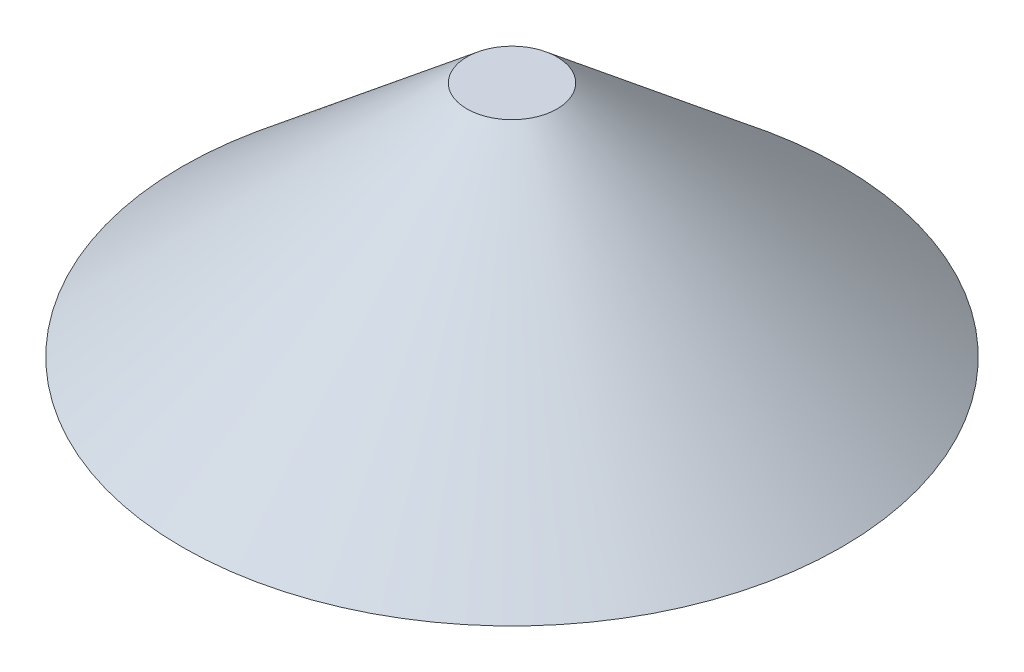
ISO-10303-21;
HEADER;
FILE_DESCRIPTION(('STEP AP214'),'2;1');
FILE_NAME('part.step','',(''),(''),'','','');
FILE_SCHEMA(('AUTOMOTIVE_DESIGN { 1 0 10303 214 1 1 1 1 }'));
ENDSEC;
DATA;
#1=APPLICATION_CONTEXT('core data for automotive mechanical design processes');
#2=APPLICATION_PROTOCOL_DEFINITION('international standard','automotive_design',2000,#1);
#3=PRODUCT_CONTEXT('',#1,'mechanical');
#4=PRODUCT('Part','Part','',(#3));
#5=PRODUCT_RELATED_PRODUCT_CATEGORY('part','',(#4));
#6=PRODUCT_DEFINITION_FORMATION('','',#4);
#7=PRODUCT_DEFINITION_CONTEXT('part definition',#1,'design');
#8=PRODUCT_DEFINITION('design','',#6,#7);
#9=PRODUCT_DEFINITION_SHAPE('','',#8);
#10=(LENGTH_UNIT() NAMED_UNIT(*) SI_UNIT(.MILLI.,.METRE.));
#11=(NAMED_UNIT(*) PLANE_ANGLE_UNIT() SI_UNIT($,.RADIAN.));
#12=(NAMED_UNIT(*) SI_UNIT($,.STERADIAN.) SOLID_ANGLE_UNIT());
#13=UNCERTAINTY_MEASURE_WITH_UNIT(LENGTH_MEASURE(1.E-05),#10,'distance_accuracy_value','');
#14=(GEOMETRIC_REPRESENTATION_CONTEXT(3) GLOBAL_UNCERTAINTY_ASSIGNED_CONTEXT((#13)) GLOBAL_UNIT_ASSIGNED_CONTEXT((#10,
#11,#12)) REPRESENTATION_CONTEXT('',''));
#15=CARTESIAN_POINT('',(0.,0.,0.));
#16=DIRECTION('',(0.,0.,1.));
#17=DIRECTION('',(1.,0.,0.));
#18=AXIS2_PLACEMENT_3D('',#15,#16,#17);
#19=CARTESIAN_POINT('',(0.,0.,0.));
#20=DIRECTION('',(0.,-1.,0.));
#21=DIRECTION('',(0.,0.,-1.));
#22=AXIS2_PLACEMENT_3D('',#19,#20,#21);
#23=PLANE('',#22);
#24=CARTESIAN_POINT('',(0.,0.,0.));
#25=DIRECTION('',(0.,1.,0.));
#26=DIRECTION('',(0.,0.,1.));
#27=AXIS2_PLACEMENT_3D('',#24,#25,#26);
#28=CIRCLE('',#27,69.5);
#29=CARTESIAN_POINT('',(0.,0.,69.5));
#30=VERTEX_POINT('',#29);
#31=EDGE_CURVE('E10',#30,#30,#28,.T.);
#32=ORIENTED_EDGE('',*,*,#31,.F.);
#33=EDGE_LOOP('',(#32));
#34=FACE_BOUND('',#33,.T.);
#35=ADVANCED_FACE('F39',(#34),#23,.T.);
#36=CARTESIAN_POINT('',(0.,50.,0.));
#37=DIRECTION('',(0.,-1.,0.));
#38=DIRECTION('',(0.,0.,-1.));
#39=AXIS2_PLACEMENT_3D('',#36,#37,#38);
#40=CONICAL_SURFACE('',#39,9.50000000000002,0.876058050598193);
#41=ORIENTED_EDGE('',*,*,#31,.T.);
#42=EDGE_LOOP('',(#41));
#43=FACE_BOUND('',#42,.T.);
#44=CARTESIAN_POINT('',(0.,50.,0.));
#45=DIRECTION('',(0.,1.,0.));
#46=DIRECTION('',(0.,0.,1.));
#47=AXIS2_PLACEMENT_3D('',#44,#45,#46);
#48=CIRCLE('',#47,9.50000000000002);
#49=CARTESIAN_POINT('',(0.,50.,9.50000000000002));
#50=VERTEX_POINT('',#49);
#51=EDGE_CURVE('E46',#50,#50,#48,.T.);
#52=ORIENTED_EDGE('',*,*,#51,.F.);
#53=EDGE_LOOP('',(#52));
#54=FACE_BOUND('',#53,.T.);
#55=ADVANCED_FACE('F55',(#43,#54),#40,.T.);
#56=CARTESIAN_POINT('',(-9.50000000000002,50.,0.));
#57=DIRECTION('',(0.,1.,0.));
#58=DIRECTION('',(0.,0.,1.));
#59=AXIS2_PLACEMENT_3D('',#56,#57,#58);
#60=PLANE('',#59);
#61=ORIENTED_EDGE('',*,*,#51,.T.);
#62=EDGE_LOOP('',(#61));
#63=FACE_BOUND('',#62,.T.);
#64=ADVANCED_FACE('F53',(#63),#60,.T.);
#65=CLOSED_SHELL('',(#35,#55,#64));
#66=MANIFOLD_SOLID_BREP('B2',#65);
#67=ADVANCED_BREP_SHAPE_REPRESENTATION('',(#18,#66),#14);
#68=SHAPE_DEFINITION_REPRESENTATION(#9,#67);
ENDSEC;
END-ISO-10303-21;
